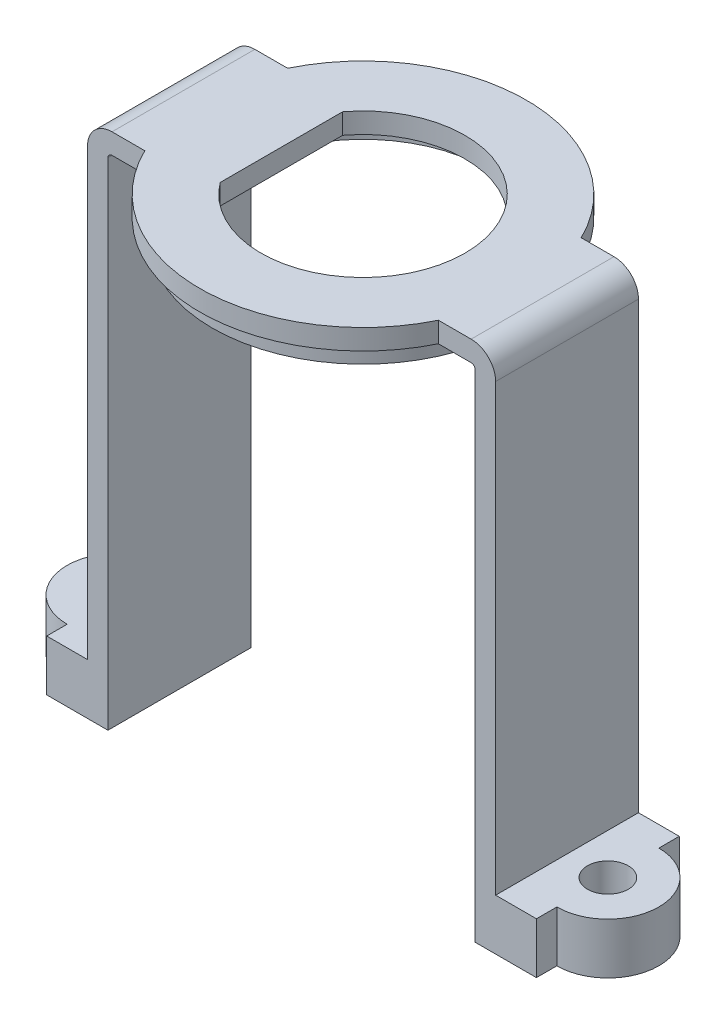
ISO-10303-21;
HEADER;
FILE_DESCRIPTION(('STEP AP214'),'2;1');
FILE_NAME('part.step','',(''),(''),'','','');
FILE_SCHEMA(('AUTOMOTIVE_DESIGN { 1 0 10303 214 1 1 1 1 }'));
ENDSEC;
DATA;
#1=APPLICATION_CONTEXT('core data for automotive mechanical design processes');
#2=APPLICATION_PROTOCOL_DEFINITION('international standard','automotive_design',2000,#1);
#3=PRODUCT_CONTEXT('',#1,'mechanical');
#4=PRODUCT('Part','Part','',(#3));
#5=PRODUCT_RELATED_PRODUCT_CATEGORY('part','',(#4));
#6=PRODUCT_DEFINITION_FORMATION('','',#4);
#7=PRODUCT_DEFINITION_CONTEXT('part definition',#1,'design');
#8=PRODUCT_DEFINITION('design','',#6,#7);
#9=PRODUCT_DEFINITION_SHAPE('','',#8);
#10=(LENGTH_UNIT() NAMED_UNIT(*) SI_UNIT(.MILLI.,.METRE.));
#11=(NAMED_UNIT(*) PLANE_ANGLE_UNIT() SI_UNIT($,.RADIAN.));
#12=(NAMED_UNIT(*) SI_UNIT($,.STERADIAN.) SOLID_ANGLE_UNIT());
#13=UNCERTAINTY_MEASURE_WITH_UNIT(LENGTH_MEASURE(1.E-05),#10,'distance_accuracy_value','');
#14=(GEOMETRIC_REPRESENTATION_CONTEXT(3) GLOBAL_UNCERTAINTY_ASSIGNED_CONTEXT((#13)) GLOBAL_UNIT_ASSIGNED_CONTEXT((#10,
#11,#12)) REPRESENTATION_CONTEXT('',''));
#15=CARTESIAN_POINT('',(0.,0.,0.));
#16=DIRECTION('',(0.,0.,1.));
#17=DIRECTION('',(1.,0.,0.));
#18=AXIS2_PLACEMENT_3D('',#15,#16,#17);
#19=CARTESIAN_POINT('',(0.,-1.,0.));
#20=DIRECTION('',(0.,1.,0.));
#21=DIRECTION('',(0.,0.,1.));
#22=AXIS2_PLACEMENT_3D('',#19,#20,#21);
#23=PLANE('',#22);
#24=DIRECTION('',(0.,0.,1.));
#25=VECTOR('',#24,1.);
#26=CARTESIAN_POINT('',(-4.,-1.,-3.));
#27=LINE('',#26,#25);
#28=CARTESIAN_POINT('',(-4.,-1.,-3.));
#29=VERTEX_POINT('',#28);
#30=CARTESIAN_POINT('',(-4.,-1.,3.));
#31=VERTEX_POINT('',#30);
#32=EDGE_CURVE('E311',#29,#31,#27,.T.);
#33=ORIENTED_EDGE('',*,*,#32,.T.);
#34=CARTESIAN_POINT('',(0.,-1.,0.));
#35=DIRECTION('',(0.,1.,0.));
#36=DIRECTION('',(0.,0.,1.));
#37=AXIS2_PLACEMENT_3D('',#34,#35,#36);
#38=CIRCLE('',#37,5.);
#39=EDGE_CURVE('E308',#31,#29,#38,.T.);
#40=ORIENTED_EDGE('',*,*,#39,.T.);
#41=EDGE_LOOP('',(#33,#40));
#42=FACE_BOUND('',#41,.T.);
#43=CARTESIAN_POINT('',(0.,-1.,0.));
#44=DIRECTION('',(0.,-1.,0.));
#45=DIRECTION('',(0.,0.,-1.));
#46=AXIS2_PLACEMENT_3D('',#43,#44,#45);
#47=CIRCLE('',#46,6.125);
#48=CARTESIAN_POINT('',(0.,-1.,-6.125));
#49=VERTEX_POINT('',#48);
#50=EDGE_CURVE('E298',#49,#49,#47,.T.);
#51=ORIENTED_EDGE('',*,*,#50,.T.);
#52=EDGE_LOOP('',(#51));
#53=FACE_BOUND('',#52,.T.);
#54=ADVANCED_FACE('F32',(#42,#53),#23,.F.);
#55=CARTESIAN_POINT('',(0.,-1.,0.));
#56=DIRECTION('',(0.,1.,0.));
#57=DIRECTION('',(0.,0.,1.));
#58=AXIS2_PLACEMENT_3D('',#55,#56,#57);
#59=CYLINDRICAL_SURFACE('',#58,8.);
#60=CARTESIAN_POINT('',(0.,0.,0.));
#61=DIRECTION('',(0.,1.,0.));
#62=DIRECTION('',(0.,0.,1.));
#63=AXIS2_PLACEMENT_3D('',#60,#61,#62);
#64=CIRCLE('',#63,8.);
#65=CARTESIAN_POINT('',(-7.19374728496908,0.,3.5));
#66=VERTEX_POINT('',#65);
#67=CARTESIAN_POINT('',(7.19374728496908,0.,3.5));
#68=VERTEX_POINT('',#67);
#69=EDGE_CURVE('E321',#66,#68,#64,.T.);
#70=ORIENTED_EDGE('',*,*,#69,.F.);
#71=DIRECTION('',(0.,1.,0.));
#72=VECTOR('',#71,1.);
#73=CARTESIAN_POINT('',(-7.19374728496908,-1.,3.5));
#74=LINE('',#73,#72);
#75=CARTESIAN_POINT('',(-7.19374728496908,-1.,3.5));
#76=VERTEX_POINT('',#75);
#77=EDGE_CURVE('E356',#76,#66,#74,.T.);
#78=ORIENTED_EDGE('',*,*,#77,.F.);
#79=CARTESIAN_POINT('',(0.,-1.,0.));
#80=DIRECTION('',(0.,1.,0.));
#81=DIRECTION('',(0.,0.,1.));
#82=AXIS2_PLACEMENT_3D('',#79,#80,#81);
#83=CIRCLE('',#82,8.);
#84=CARTESIAN_POINT('',(7.19374728496908,-1.,3.5));
#85=VERTEX_POINT('',#84);
#86=EDGE_CURVE('E324',#76,#85,#83,.T.);
#87=ORIENTED_EDGE('',*,*,#86,.T.);
#88=DIRECTION('',(0.,1.,0.));
#89=VECTOR('',#88,1.);
#90=CARTESIAN_POINT('',(7.19374728496908,-1.,3.5));
#91=LINE('',#90,#89);
#92=EDGE_CURVE('E341',#85,#68,#91,.T.);
#93=ORIENTED_EDGE('',*,*,#92,.T.);
#94=EDGE_LOOP('',(#70,#78,#87,#93));
#95=FACE_BOUND('',#94,.T.);
#96=ADVANCED_FACE('F481',(#95),#59,.T.);
#97=CARTESIAN_POINT('',(-9.99999999999999,-1.,3.5));
#98=DIRECTION('',(0.,0.,1.));
#99=DIRECTION('',(1.,0.,0.));
#100=AXIS2_PLACEMENT_3D('',#97,#98,#99);
#101=PLANE('',#100);
#102=DIRECTION('',(1.,0.,0.));
#103=VECTOR('',#102,1.);
#104=CARTESIAN_POINT('',(-9.99999999999999,0.,3.5));
#105=LINE('',#104,#103);
#106=CARTESIAN_POINT('',(-8.8,0.,3.5));
#107=VERTEX_POINT('',#106);
#108=EDGE_CURVE('E328',#107,#66,#105,.T.);
#109=ORIENTED_EDGE('',*,*,#108,.F.);
#110=CARTESIAN_POINT('',(-8.8,-1.2,3.5));
#111=DIRECTION('',(0.,0.,1.));
#112=DIRECTION('',(1.,0.,0.));
#113=AXIS2_PLACEMENT_3D('',#110,#111,#112);
#114=CIRCLE('',#113,1.2);
#115=CARTESIAN_POINT('',(-9.99999999999999,-1.2,3.5));
#116=VERTEX_POINT('',#115);
#117=EDGE_CURVE('E54',#107,#116,#114,.T.);
#118=ORIENTED_EDGE('',*,*,#117,.T.);
#119=DIRECTION('',(0.,1.,0.));
#120=VECTOR('',#119,1.);
#121=CARTESIAN_POINT('',(-9.99999999999999,-1.,3.5));
#122=LINE('',#121,#120);
#123=CARTESIAN_POINT('',(-9.99999999999999,-23.,3.5));
#124=VERTEX_POINT('',#123);
#125=EDGE_CURVE('E360',#124,#116,#122,.T.);
#126=ORIENTED_EDGE('',*,*,#125,.F.);
#127=DIRECTION('',(-1.,0.,0.));
#128=VECTOR('',#127,1.);
#129=CARTESIAN_POINT('',(-8.99999999999999,-23.,3.5));
#130=LINE('',#129,#128);
#131=CARTESIAN_POINT('',(-12.,-23.,3.5));
#132=VERTEX_POINT('',#131);
#133=EDGE_CURVE('E268',#124,#132,#130,.T.);
#134=ORIENTED_EDGE('',*,*,#133,.T.);
#135=DIRECTION('',(0.,1.,0.));
#136=VECTOR('',#135,1.);
#137=CARTESIAN_POINT('',(-12.,-25.5,3.5));
#138=LINE('',#137,#136);
#139=CARTESIAN_POINT('',(-12.,-25.5,3.5));
#140=VERTEX_POINT('',#139);
#141=EDGE_CURVE('E273',#140,#132,#138,.T.);
#142=ORIENTED_EDGE('',*,*,#141,.F.);
#143=DIRECTION('',(-1.,0.,0.));
#144=VECTOR('',#143,1.);
#145=CARTESIAN_POINT('',(-8.99999999999999,-25.5,3.5));
#146=LINE('',#145,#144);
#147=CARTESIAN_POINT('',(-8.99999999999999,-25.5,3.5));
#148=VERTEX_POINT('',#147);
#149=EDGE_CURVE('E256',#148,#140,#146,.T.);
#150=ORIENTED_EDGE('',*,*,#149,.F.);
#151=DIRECTION('',(0.,1.,0.));
#152=VECTOR('',#151,1.);
#153=CARTESIAN_POINT('',(-8.99999999999999,-1.,3.5));
#154=LINE('',#153,#152);
#155=CARTESIAN_POINT('',(-8.99999999999999,-1.2,3.5));
#156=VERTEX_POINT('',#155);
#157=EDGE_CURVE('E289',#148,#156,#154,.T.);
#158=ORIENTED_EDGE('',*,*,#157,.T.);
#159=CARTESIAN_POINT('',(-8.79999999999999,-1.2,3.5));
#160=DIRECTION('',(0.,0.,1.));
#161=DIRECTION('',(1.,0.,0.));
#162=AXIS2_PLACEMENT_3D('',#159,#160,#161);
#163=CIRCLE('',#162,0.2);
#164=CARTESIAN_POINT('',(-8.79999999999999,-1.,3.5));
#165=VERTEX_POINT('',#164);
#166=EDGE_CURVE('E392',#156,#165,#163,.F.);
#167=ORIENTED_EDGE('',*,*,#166,.T.);
#168=DIRECTION('',(1.,0.,0.));
#169=VECTOR('',#168,1.);
#170=CARTESIAN_POINT('',(-9.99999999999999,-1.,3.5));
#171=LINE('',#170,#169);
#172=EDGE_CURVE('E339',#165,#76,#171,.T.);
#173=ORIENTED_EDGE('',*,*,#172,.T.);
#174=ORIENTED_EDGE('',*,*,#77,.T.);
#175=EDGE_LOOP('',(#109,#118,#126,#134,#142,#150,#158,#167,#173,#174));
#176=FACE_BOUND('',#175,.T.);
#177=ADVANCED_FACE('F488',(#176),#101,.T.);
#178=CARTESIAN_POINT('',(-9.99999999999999,-1.,-3.5));
#179=DIRECTION('',(-1.,0.,0.));
#180=DIRECTION('',(0.,0.,1.));
#181=AXIS2_PLACEMENT_3D('',#178,#179,#180);
#182=PLANE('',#181);
#183=ORIENTED_EDGE('',*,*,#125,.T.);
#184=DIRECTION('',(0.,0.,1.));
#185=VECTOR('',#184,1.);
#186=CARTESIAN_POINT('',(-9.99999999999999,-1.2,-3.5));
#187=LINE('',#186,#185);
#188=CARTESIAN_POINT('',(-9.99999999999999,-1.2,-3.5));
#189=VERTEX_POINT('',#188);
#190=EDGE_CURVE('E40',#116,#189,#187,.F.);
#191=ORIENTED_EDGE('',*,*,#190,.T.);
#192=DIRECTION('',(0.,1.,0.));
#193=VECTOR('',#192,1.);
#194=CARTESIAN_POINT('',(-9.99999999999999,-1.,-3.5));
#195=LINE('',#194,#193);
#196=CARTESIAN_POINT('',(-9.99999999999999,-23.,-3.5));
#197=VERTEX_POINT('',#196);
#198=EDGE_CURVE('E362',#197,#189,#195,.T.);
#199=ORIENTED_EDGE('',*,*,#198,.F.);
#200=DIRECTION('',(0.,0.,1.));
#201=VECTOR('',#200,1.);
#202=CARTESIAN_POINT('',(-9.99999999999999,-23.,-3.5));
#203=LINE('',#202,#201);
#204=EDGE_CURVE('E295',#197,#124,#203,.T.);
#205=ORIENTED_EDGE('',*,*,#204,.T.);
#206=EDGE_LOOP('',(#183,#191,#199,#205));
#207=FACE_BOUND('',#206,.T.);
#208=ADVANCED_FACE('F622',(#207),#182,.T.);
#209=CARTESIAN_POINT('',(-9.99999999999999,-1.,-3.5));
#210=DIRECTION('',(0.,0.,-1.));
#211=DIRECTION('',(-1.,0.,0.));
#212=AXIS2_PLACEMENT_3D('',#209,#210,#211);
#213=PLANE('',#212);
#214=ORIENTED_EDGE('',*,*,#198,.T.);
#215=CARTESIAN_POINT('',(-8.8,-1.2,-3.5));
#216=DIRECTION('',(0.,0.,-1.));
#217=DIRECTION('',(-1.,0.,0.));
#218=AXIS2_PLACEMENT_3D('',#215,#216,#217);
#219=CIRCLE('',#218,1.2);
#220=CARTESIAN_POINT('',(-8.8,0.,-3.5));
#221=VERTEX_POINT('',#220);
#222=EDGE_CURVE('E11',#189,#221,#219,.T.);
#223=ORIENTED_EDGE('',*,*,#222,.T.);
#224=DIRECTION('',(-1.,0.,0.));
#225=VECTOR('',#224,1.);
#226=CARTESIAN_POINT('',(-9.99999999999999,0.,-3.5));
#227=LINE('',#226,#225);
#228=CARTESIAN_POINT('',(-7.19374728496908,0.,-3.5));
#229=VERTEX_POINT('',#228);
#230=EDGE_CURVE('E352',#229,#221,#227,.T.);
#231=ORIENTED_EDGE('',*,*,#230,.F.);
#232=DIRECTION('',(0.,1.,0.));
#233=VECTOR('',#232,1.);
#234=CARTESIAN_POINT('',(-7.19374728496908,-1.,-3.5));
#235=LINE('',#234,#233);
#236=CARTESIAN_POINT('',(-7.19374728496908,-1.,-3.5));
#237=VERTEX_POINT('',#236);
#238=EDGE_CURVE('E364',#237,#229,#235,.T.);
#239=ORIENTED_EDGE('',*,*,#238,.F.);
#240=DIRECTION('',(-1.,0.,0.));
#241=VECTOR('',#240,1.);
#242=CARTESIAN_POINT('',(-9.99999999999999,-1.,-3.5));
#243=LINE('',#242,#241);
#244=CARTESIAN_POINT('',(-8.79999999999999,-1.,-3.5));
#245=VERTEX_POINT('',#244);
#246=EDGE_CURVE('E336',#237,#245,#243,.T.);
#247=ORIENTED_EDGE('',*,*,#246,.T.);
#248=CARTESIAN_POINT('',(-8.79999999999999,-1.2,-3.5));
#249=DIRECTION('',(0.,0.,-1.));
#250=DIRECTION('',(-1.,0.,0.));
#251=AXIS2_PLACEMENT_3D('',#248,#249,#250);
#252=CIRCLE('',#251,0.2);
#253=CARTESIAN_POINT('',(-8.99999999999999,-1.2,-3.5));
#254=VERTEX_POINT('',#253);
#255=EDGE_CURVE('E394',#245,#254,#252,.F.);
#256=ORIENTED_EDGE('',*,*,#255,.T.);
#257=DIRECTION('',(0.,1.,0.));
#258=VECTOR('',#257,1.);
#259=CARTESIAN_POINT('',(-8.99999999999999,-1.,-3.5));
#260=LINE('',#259,#258);
#261=CARTESIAN_POINT('',(-8.99999999999999,-25.5,-3.5));
#262=VERTEX_POINT('',#261);
#263=EDGE_CURVE('E292',#262,#254,#260,.T.);
#264=ORIENTED_EDGE('',*,*,#263,.F.);
#265=DIRECTION('',(1.,0.,0.));
#266=VECTOR('',#265,1.);
#267=CARTESIAN_POINT('',(-8.99999999999999,-25.5,-3.5));
#268=LINE('',#267,#266);
#269=CARTESIAN_POINT('',(-12.,-25.5,-3.5));
#270=VERTEX_POINT('',#269);
#271=EDGE_CURVE('E250',#270,#262,#268,.T.);
#272=ORIENTED_EDGE('',*,*,#271,.F.);
#273=DIRECTION('',(0.,1.,0.));
#274=VECTOR('',#273,1.);
#275=CARTESIAN_POINT('',(-12.,-25.5,-3.5));
#276=LINE('',#275,#274);
#277=CARTESIAN_POINT('',(-12.,-23.,-3.5));
#278=VERTEX_POINT('',#277);
#279=EDGE_CURVE('E276',#270,#278,#276,.T.);
#280=ORIENTED_EDGE('',*,*,#279,.T.);
#281=DIRECTION('',(1.,0.,0.));
#282=VECTOR('',#281,1.);
#283=CARTESIAN_POINT('',(-8.99999999999999,-23.,-3.5));
#284=LINE('',#283,#282);
#285=EDGE_CURVE('E265',#278,#197,#284,.T.);
#286=ORIENTED_EDGE('',*,*,#285,.T.);
#287=EDGE_LOOP('',(#214,#223,#231,#239,#247,#256,#264,#272,#280,#286));
#288=FACE_BOUND('',#287,.T.);
#289=ADVANCED_FACE('F633',(#288),#213,.T.);
#290=CARTESIAN_POINT('',(0.,-1.,0.));
#291=DIRECTION('',(0.,1.,0.));
#292=DIRECTION('',(0.,0.,1.));
#293=AXIS2_PLACEMENT_3D('',#290,#291,#292);
#294=CYLINDRICAL_SURFACE('',#293,8.);
#295=CARTESIAN_POINT('',(0.,0.,0.));
#296=DIRECTION('',(0.,1.,0.));
#297=DIRECTION('',(0.,0.,1.));
#298=AXIS2_PLACEMENT_3D('',#295,#296,#297);
#299=CIRCLE('',#298,8.);
#300=CARTESIAN_POINT('',(7.19374728496908,0.,-3.5));
#301=VERTEX_POINT('',#300);
#302=EDGE_CURVE('E349',#301,#229,#299,.T.);
#303=ORIENTED_EDGE('',*,*,#302,.F.);
#304=DIRECTION('',(0.,1.,0.));
#305=VECTOR('',#304,1.);
#306=CARTESIAN_POINT('',(7.19374728496908,-1.,-3.5));
#307=LINE('',#306,#305);
#308=CARTESIAN_POINT('',(7.19374728496908,-1.,-3.5));
#309=VERTEX_POINT('',#308);
#310=EDGE_CURVE('E366',#309,#301,#307,.T.);
#311=ORIENTED_EDGE('',*,*,#310,.F.);
#312=CARTESIAN_POINT('',(0.,-1.,0.));
#313=DIRECTION('',(0.,1.,0.));
#314=DIRECTION('',(0.,0.,1.));
#315=AXIS2_PLACEMENT_3D('',#312,#313,#314);
#316=CIRCLE('',#315,8.);
#317=EDGE_CURVE('E333',#309,#237,#316,.T.);
#318=ORIENTED_EDGE('',*,*,#317,.T.);
#319=ORIENTED_EDGE('',*,*,#238,.T.);
#320=EDGE_LOOP('',(#303,#311,#318,#319));
#321=FACE_BOUND('',#320,.T.);
#322=ADVANCED_FACE('F643',(#321),#294,.T.);
#323=CARTESIAN_POINT('',(7.19374728496908,-1.,-3.5));
#324=DIRECTION('',(0.,0.,-1.));
#325=DIRECTION('',(-1.,0.,0.));
#326=AXIS2_PLACEMENT_3D('',#323,#324,#325);
#327=PLANE('',#326);
#328=DIRECTION('',(-1.,0.,0.));
#329=VECTOR('',#328,1.);
#330=CARTESIAN_POINT('',(7.19374728496908,0.,-3.5));
#331=LINE('',#330,#329);
#332=CARTESIAN_POINT('',(8.8,0.,-3.5));
#333=VERTEX_POINT('',#332);
#334=EDGE_CURVE('E347',#333,#301,#331,.T.);
#335=ORIENTED_EDGE('',*,*,#334,.F.);
#336=CARTESIAN_POINT('',(8.8,-1.2,-3.5));
#337=DIRECTION('',(0.,0.,-1.));
#338=DIRECTION('',(-1.,0.,0.));
#339=AXIS2_PLACEMENT_3D('',#336,#337,#338);
#340=CIRCLE('',#339,1.2);
#341=CARTESIAN_POINT('',(10.,-1.2,-3.5));
#342=VERTEX_POINT('',#341);
#343=EDGE_CURVE('E402',#333,#342,#340,.T.);
#344=ORIENTED_EDGE('',*,*,#343,.T.);
#345=DIRECTION('',(0.,1.,0.));
#346=VECTOR('',#345,1.);
#347=CARTESIAN_POINT('',(10.,-1.,-3.5));
#348=LINE('',#347,#346);
#349=CARTESIAN_POINT('',(10.,-23.,-3.5));
#350=VERTEX_POINT('',#349);
#351=EDGE_CURVE('E369',#350,#342,#348,.T.);
#352=ORIENTED_EDGE('',*,*,#351,.F.);
#353=DIRECTION('',(1.,0.,0.));
#354=VECTOR('',#353,1.);
#355=CARTESIAN_POINT('',(8.99999999999999,-23.,-3.5));
#356=LINE('',#355,#354);
#357=CARTESIAN_POINT('',(12.,-23.,-3.5));
#358=VERTEX_POINT('',#357);
#359=EDGE_CURVE('E430',#350,#358,#356,.T.);
#360=ORIENTED_EDGE('',*,*,#359,.T.);
#361=DIRECTION('',(0.,1.,0.));
#362=VECTOR('',#361,1.);
#363=CARTESIAN_POINT('',(12.,-25.5,-3.5));
#364=LINE('',#363,#362);
#365=CARTESIAN_POINT('',(12.,-25.5,-3.5));
#366=VERTEX_POINT('',#365);
#367=EDGE_CURVE('E237',#366,#358,#364,.T.);
#368=ORIENTED_EDGE('',*,*,#367,.F.);
#369=DIRECTION('',(1.,0.,0.));
#370=VECTOR('',#369,1.);
#371=CARTESIAN_POINT('',(8.99999999999999,-25.5,-3.5));
#372=LINE('',#371,#370);
#373=CARTESIAN_POINT('',(8.99999999999999,-25.5,-3.5));
#374=VERTEX_POINT('',#373);
#375=EDGE_CURVE('E447',#374,#366,#372,.T.);
#376=ORIENTED_EDGE('',*,*,#375,.F.);
#377=DIRECTION('',(0.,-1.,0.));
#378=VECTOR('',#377,1.);
#379=CARTESIAN_POINT('',(8.99999999999999,-0.999999999999998,-3.5));
#380=LINE('',#379,#378);
#381=CARTESIAN_POINT('',(8.99999999999999,-1.2,-3.5));
#382=VERTEX_POINT('',#381);
#383=EDGE_CURVE('E284',#382,#374,#380,.T.);
#384=ORIENTED_EDGE('',*,*,#383,.F.);
#385=CARTESIAN_POINT('',(8.79999999999999,-1.2,-3.5));
#386=DIRECTION('',(0.,0.,-1.));
#387=DIRECTION('',(-1.,0.,0.));
#388=AXIS2_PLACEMENT_3D('',#385,#386,#387);
#389=CIRCLE('',#388,0.2);
#390=CARTESIAN_POINT('',(8.79999999999999,-1.,-3.5));
#391=VERTEX_POINT('',#390);
#392=EDGE_CURVE('E390',#382,#391,#389,.F.);
#393=ORIENTED_EDGE('',*,*,#392,.T.);
#394=DIRECTION('',(-1.,0.,0.));
#395=VECTOR('',#394,1.);
#396=CARTESIAN_POINT('',(7.19374728496908,-1.,-3.5));
#397=LINE('',#396,#395);
#398=EDGE_CURVE('E331',#391,#309,#397,.T.);
#399=ORIENTED_EDGE('',*,*,#398,.T.);
#400=ORIENTED_EDGE('',*,*,#310,.T.);
#401=EDGE_LOOP('',(#335,#344,#352,#360,#368,#376,#384,#393,#399,#400));
#402=FACE_BOUND('',#401,.T.);
#403=ADVANCED_FACE('F422',(#402),#327,.T.);
#404=CARTESIAN_POINT('',(10.,-1.,-3.5));
#405=DIRECTION('',(1.,0.,0.));
#406=DIRECTION('',(0.,0.,-1.));
#407=AXIS2_PLACEMENT_3D('',#404,#405,#406);
#408=PLANE('',#407);
#409=ORIENTED_EDGE('',*,*,#351,.T.);
#410=DIRECTION('',(0.,0.,-1.));
#411=VECTOR('',#410,1.);
#412=CARTESIAN_POINT('',(10.,-1.2,-3.5));
#413=LINE('',#412,#411);
#414=CARTESIAN_POINT('',(10.,-1.2,3.5));
#415=VERTEX_POINT('',#414);
#416=EDGE_CURVE('E404',#342,#415,#413,.F.);
#417=ORIENTED_EDGE('',*,*,#416,.T.);
#418=DIRECTION('',(0.,1.,0.));
#419=VECTOR('',#418,1.);
#420=CARTESIAN_POINT('',(10.,-1.,3.5));
#421=LINE('',#420,#419);
#422=CARTESIAN_POINT('',(10.,-23.,3.5));
#423=VERTEX_POINT('',#422);
#424=EDGE_CURVE('E372',#423,#415,#421,.T.);
#425=ORIENTED_EDGE('',*,*,#424,.F.);
#426=DIRECTION('',(0.,0.,1.));
#427=VECTOR('',#426,1.);
#428=CARTESIAN_POINT('',(10.,-23.,-3.5));
#429=LINE('',#428,#427);
#430=EDGE_CURVE('E286',#350,#423,#429,.T.);
#431=ORIENTED_EDGE('',*,*,#430,.F.);
#432=EDGE_LOOP('',(#409,#417,#425,#431));
#433=FACE_BOUND('',#432,.T.);
#434=ADVANCED_FACE('F425',(#433),#408,.T.);
#435=CARTESIAN_POINT('',(7.19374728496908,-1.,3.5));
#436=DIRECTION('',(0.,0.,1.));
#437=DIRECTION('',(1.,0.,0.));
#438=AXIS2_PLACEMENT_3D('',#435,#436,#437);
#439=PLANE('',#438);
#440=ORIENTED_EDGE('',*,*,#424,.T.);
#441=CARTESIAN_POINT('',(8.8,-1.2,3.5));
#442=DIRECTION('',(0.,0.,1.));
#443=DIRECTION('',(1.,0.,0.));
#444=AXIS2_PLACEMENT_3D('',#441,#442,#443);
#445=CIRCLE('',#444,1.2);
#446=CARTESIAN_POINT('',(8.8,0.,3.5));
#447=VERTEX_POINT('',#446);
#448=EDGE_CURVE('E406',#415,#447,#445,.T.);
#449=ORIENTED_EDGE('',*,*,#448,.T.);
#450=DIRECTION('',(1.,0.,0.));
#451=VECTOR('',#450,1.);
#452=CARTESIAN_POINT('',(7.19374728496908,0.,3.5));
#453=LINE('',#452,#451);
#454=EDGE_CURVE('E344',#68,#447,#453,.T.);
#455=ORIENTED_EDGE('',*,*,#454,.F.);
#456=ORIENTED_EDGE('',*,*,#92,.F.);
#457=DIRECTION('',(1.,0.,0.));
#458=VECTOR('',#457,1.);
#459=CARTESIAN_POINT('',(7.19374728496908,-1.,3.5));
#460=LINE('',#459,#458);
#461=CARTESIAN_POINT('',(8.79999999999999,-1.,3.5));
#462=VERTEX_POINT('',#461);
#463=EDGE_CURVE('E327',#85,#462,#460,.T.);
#464=ORIENTED_EDGE('',*,*,#463,.T.);
#465=CARTESIAN_POINT('',(8.79999999999999,-1.2,3.5));
#466=DIRECTION('',(0.,0.,1.));
#467=DIRECTION('',(1.,0.,0.));
#468=AXIS2_PLACEMENT_3D('',#465,#466,#467);
#469=CIRCLE('',#468,0.2);
#470=CARTESIAN_POINT('',(8.99999999999999,-1.2,3.5));
#471=VERTEX_POINT('',#470);
#472=EDGE_CURVE('E388',#462,#471,#469,.F.);
#473=ORIENTED_EDGE('',*,*,#472,.T.);
#474=DIRECTION('',(0.,-1.,0.));
#475=VECTOR('',#474,1.);
#476=CARTESIAN_POINT('',(8.99999999999999,-0.999999999999998,3.5));
#477=LINE('',#476,#475);
#478=CARTESIAN_POINT('',(8.99999999999999,-25.5,3.5));
#479=VERTEX_POINT('',#478);
#480=EDGE_CURVE('E282',#471,#479,#477,.T.);
#481=ORIENTED_EDGE('',*,*,#480,.T.);
#482=DIRECTION('',(-1.,0.,0.));
#483=VECTOR('',#482,1.);
#484=CARTESIAN_POINT('',(8.99999999999999,-25.5,3.5));
#485=LINE('',#484,#483);
#486=CARTESIAN_POINT('',(12.,-25.5,3.5));
#487=VERTEX_POINT('',#486);
#488=EDGE_CURVE('E216',#487,#479,#485,.T.);
#489=ORIENTED_EDGE('',*,*,#488,.F.);
#490=DIRECTION('',(0.,1.,0.));
#491=VECTOR('',#490,1.);
#492=CARTESIAN_POINT('',(12.,-25.5,3.5));
#493=LINE('',#492,#491);
#494=CARTESIAN_POINT('',(12.,-23.,3.5));
#495=VERTEX_POINT('',#494);
#496=EDGE_CURVE('E212',#487,#495,#493,.T.);
#497=ORIENTED_EDGE('',*,*,#496,.T.);
#498=DIRECTION('',(-1.,0.,0.));
#499=VECTOR('',#498,1.);
#500=CARTESIAN_POINT('',(8.99999999999999,-23.,3.5));
#501=LINE('',#500,#499);
#502=EDGE_CURVE('E435',#495,#423,#501,.T.);
#503=ORIENTED_EDGE('',*,*,#502,.T.);
#504=EDGE_LOOP('',(#440,#449,#455,#456,#464,#473,#481,#489,#497,#503));
#505=FACE_BOUND('',#504,.T.);
#506=ADVANCED_FACE('F411',(#505),#439,.T.);
#507=CARTESIAN_POINT('',(0.,-1.,0.));
#508=DIRECTION('',(0.,1.,0.));
#509=DIRECTION('',(0.,0.,1.));
#510=AXIS2_PLACEMENT_3D('',#507,#508,#509);
#511=CIRCLE('',#510,7.375);
#512=CARTESIAN_POINT('',(0.,-1.,7.375));
#513=VERTEX_POINT('',#512);
#514=EDGE_CURVE('E359',#513,#513,#511,.F.);
#515=ORIENTED_EDGE('',*,*,#514,.F.);
#516=EDGE_LOOP('',(#515));
#517=FACE_BOUND('',#516,.T.);
#518=ORIENTED_EDGE('',*,*,#398,.F.);
#519=DIRECTION('',(0.,0.,1.));
#520=VECTOR('',#519,1.);
#521=CARTESIAN_POINT('',(8.79999999999999,-1.,0.));
#522=LINE('',#521,#520);
#523=EDGE_CURVE('E380',#391,#462,#522,.T.);
#524=ORIENTED_EDGE('',*,*,#523,.T.);
#525=ORIENTED_EDGE('',*,*,#463,.F.);
#526=ORIENTED_EDGE('',*,*,#86,.F.);
#527=ORIENTED_EDGE('',*,*,#172,.F.);
#528=DIRECTION('',(0.,0.,1.));
#529=VECTOR('',#528,1.);
#530=CARTESIAN_POINT('',(-8.79999999999999,-1.,0.));
#531=LINE('',#530,#529);
#532=EDGE_CURVE('E378',#165,#245,#531,.F.);
#533=ORIENTED_EDGE('',*,*,#532,.T.);
#534=ORIENTED_EDGE('',*,*,#246,.F.);
#535=ORIENTED_EDGE('',*,*,#317,.F.);
#536=EDGE_LOOP('',(#518,#524,#525,#526,#527,#533,#534,#535));
#537=FACE_BOUND('',#536,.T.);
#538=ADVANCED_FACE('F484',(#517,#537),#23,.F.);
#539=CARTESIAN_POINT('',(0.,0.,0.));
#540=DIRECTION('',(0.,1.,0.));
#541=DIRECTION('',(0.,0.,1.));
#542=AXIS2_PLACEMENT_3D('',#539,#540,#541);
#543=PLANE('',#542);
#544=CARTESIAN_POINT('',(0.,0.,0.));
#545=DIRECTION('',(0.,1.,0.));
#546=DIRECTION('',(0.,0.,1.));
#547=AXIS2_PLACEMENT_3D('',#544,#545,#546);
#548=CIRCLE('',#547,5.);
#549=CARTESIAN_POINT('',(-4.,0.,3.));
#550=VERTEX_POINT('',#549);
#551=CARTESIAN_POINT('',(-4.,0.,-3.));
#552=VERTEX_POINT('',#551);
#553=EDGE_CURVE('E307',#550,#552,#548,.T.);
#554=ORIENTED_EDGE('',*,*,#553,.F.);
#555=DIRECTION('',(0.,0.,1.));
#556=VECTOR('',#555,1.);
#557=CARTESIAN_POINT('',(-4.,0.,-3.));
#558=LINE('',#557,#556);
#559=EDGE_CURVE('E312',#552,#550,#558,.T.);
#560=ORIENTED_EDGE('',*,*,#559,.F.);
#561=EDGE_LOOP('',(#554,#560));
#562=FACE_BOUND('',#561,.T.);
#563=ORIENTED_EDGE('',*,*,#454,.T.);
#564=DIRECTION('',(0.,0.,-1.));
#565=VECTOR('',#564,1.);
#566=CARTESIAN_POINT('',(8.8,0.,0.));
#567=LINE('',#566,#565);
#568=EDGE_CURVE('E399',#447,#333,#567,.T.);
#569=ORIENTED_EDGE('',*,*,#568,.T.);
#570=ORIENTED_EDGE('',*,*,#334,.T.);
#571=ORIENTED_EDGE('',*,*,#302,.T.);
#572=ORIENTED_EDGE('',*,*,#230,.T.);
#573=DIRECTION('',(0.,0.,1.));
#574=VECTOR('',#573,1.);
#575=CARTESIAN_POINT('',(-8.8,0.,0.));
#576=LINE('',#575,#574);
#577=EDGE_CURVE('E396',#221,#107,#576,.T.);
#578=ORIENTED_EDGE('',*,*,#577,.T.);
#579=ORIENTED_EDGE('',*,*,#108,.T.);
#580=ORIENTED_EDGE('',*,*,#69,.T.);
#581=EDGE_LOOP('',(#563,#569,#570,#571,#572,#578,#579,#580));
#582=FACE_BOUND('',#581,.T.);
#583=ADVANCED_FACE('F417',(#562,#582),#543,.T.);
#584=CARTESIAN_POINT('',(0.,-1.,0.));
#585=DIRECTION('',(0.,1.,0.));
#586=DIRECTION('',(0.,0.,1.));
#587=AXIS2_PLACEMENT_3D('',#584,#585,#586);
#588=CYLINDRICAL_SURFACE('',#587,5.);
#589=ORIENTED_EDGE('',*,*,#553,.T.);
#590=DIRECTION('',(0.,1.,0.));
#591=VECTOR('',#590,1.);
#592=CARTESIAN_POINT('',(-4.,-1.,-3.));
#593=LINE('',#592,#591);
#594=EDGE_CURVE('E315',#29,#552,#593,.T.);
#595=ORIENTED_EDGE('',*,*,#594,.F.);
#596=ORIENTED_EDGE('',*,*,#39,.F.);
#597=DIRECTION('',(0.,1.,0.));
#598=VECTOR('',#597,1.);
#599=CARTESIAN_POINT('',(-4.,-1.,3.));
#600=LINE('',#599,#598);
#601=EDGE_CURVE('E319',#31,#550,#600,.T.);
#602=ORIENTED_EDGE('',*,*,#601,.T.);
#603=EDGE_LOOP('',(#589,#595,#596,#602));
#604=FACE_BOUND('',#603,.T.);
#605=ADVANCED_FACE('F500',(#604),#588,.F.);
#606=CARTESIAN_POINT('',(-4.,-1.,-3.));
#607=DIRECTION('',(-1.,0.,0.));
#608=DIRECTION('',(0.,0.,1.));
#609=AXIS2_PLACEMENT_3D('',#606,#607,#608);
#610=PLANE('',#609);
#611=ORIENTED_EDGE('',*,*,#559,.T.);
#612=ORIENTED_EDGE('',*,*,#601,.F.);
#613=ORIENTED_EDGE('',*,*,#32,.F.);
#614=ORIENTED_EDGE('',*,*,#594,.T.);
#615=EDGE_LOOP('',(#611,#612,#613,#614));
#616=FACE_BOUND('',#615,.T.);
#617=ADVANCED_FACE('F541',(#616),#610,.F.);
#618=CARTESIAN_POINT('',(0.,-2.,0.));
#619=DIRECTION('',(0.,-1.,0.));
#620=DIRECTION('',(0.,0.,-1.));
#621=AXIS2_PLACEMENT_3D('',#618,#619,#620);
#622=PLANE('',#621);
#623=CARTESIAN_POINT('',(0.,-2.,0.));
#624=DIRECTION('',(0.,-1.,0.));
#625=DIRECTION('',(0.,0.,-1.));
#626=AXIS2_PLACEMENT_3D('',#623,#624,#625);
#627=CIRCLE('',#626,7.375);
#628=CARTESIAN_POINT('',(0.,-2.,-7.375));
#629=VERTEX_POINT('',#628);
#630=EDGE_CURVE('E302',#629,#629,#627,.T.);
#631=ORIENTED_EDGE('',*,*,#630,.T.);
#632=EDGE_LOOP('',(#631));
#633=FACE_BOUND('',#632,.T.);
#634=CARTESIAN_POINT('',(0.,-2.,0.));
#635=DIRECTION('',(0.,-1.,0.));
#636=DIRECTION('',(0.,0.,-1.));
#637=AXIS2_PLACEMENT_3D('',#634,#635,#636);
#638=CIRCLE('',#637,6.125);
#639=CARTESIAN_POINT('',(0.,-2.,-6.125));
#640=VERTEX_POINT('',#639);
#641=EDGE_CURVE('E299',#640,#640,#638,.T.);
#642=ORIENTED_EDGE('',*,*,#641,.F.);
#643=EDGE_LOOP('',(#642));
#644=FACE_BOUND('',#643,.T.);
#645=ADVANCED_FACE('F538',(#633,#644),#622,.T.);
#646=CARTESIAN_POINT('',(0.,-2.,0.));
#647=DIRECTION('',(0.,1.,0.));
#648=DIRECTION('',(0.,0.,1.));
#649=AXIS2_PLACEMENT_3D('',#646,#647,#648);
#650=CYLINDRICAL_SURFACE('',#649,7.375);
#651=ORIENTED_EDGE('',*,*,#630,.F.);
#652=EDGE_LOOP('',(#651));
#653=FACE_BOUND('',#652,.T.);
#654=ORIENTED_EDGE('',*,*,#514,.T.);
#655=EDGE_LOOP('',(#654));
#656=FACE_BOUND('',#655,.T.);
#657=ADVANCED_FACE('F536',(#653,#656),#650,.T.);
#658=CARTESIAN_POINT('',(0.,-2.,0.));
#659=DIRECTION('',(0.,1.,0.));
#660=DIRECTION('',(0.,0.,1.));
#661=AXIS2_PLACEMENT_3D('',#658,#659,#660);
#662=CYLINDRICAL_SURFACE('',#661,6.125);
#663=ORIENTED_EDGE('',*,*,#641,.T.);
#664=EDGE_LOOP('',(#663));
#665=FACE_BOUND('',#664,.T.);
#666=ORIENTED_EDGE('',*,*,#50,.F.);
#667=EDGE_LOOP('',(#666));
#668=FACE_BOUND('',#667,.T.);
#669=ADVANCED_FACE('F527',(#665,#668),#662,.F.);
#670=CARTESIAN_POINT('',(-8.99999999999999,-1.,-3.5));
#671=DIRECTION('',(1.,0.,0.));
#672=DIRECTION('',(0.,1.,0.));
#673=AXIS2_PLACEMENT_3D('',#670,#671,#672);
#674=PLANE('',#673);
#675=ORIENTED_EDGE('',*,*,#263,.T.);
#676=DIRECTION('',(0.,0.,1.));
#677=VECTOR('',#676,1.);
#678=CARTESIAN_POINT('',(-8.99999999999999,-1.2,-3.5));
#679=LINE('',#678,#677);
#680=EDGE_CURVE('E385',#254,#156,#679,.T.);
#681=ORIENTED_EDGE('',*,*,#680,.T.);
#682=ORIENTED_EDGE('',*,*,#157,.F.);
#683=DIRECTION('',(0.,0.,1.));
#684=VECTOR('',#683,1.);
#685=CARTESIAN_POINT('',(-8.99999999999999,-25.5,3.5));
#686=LINE('',#685,#684);
#687=EDGE_CURVE('E253',#262,#148,#686,.T.);
#688=ORIENTED_EDGE('',*,*,#687,.F.);
#689=EDGE_LOOP('',(#675,#681,#682,#688));
#690=FACE_BOUND('',#689,.T.);
#691=ADVANCED_FACE('F518',(#690),#674,.T.);
#692=CARTESIAN_POINT('',(8.99999999999999,-0.999999999999998,-3.5));
#693=DIRECTION('',(-1.,0.,0.));
#694=DIRECTION('',(0.,-1.,0.));
#695=AXIS2_PLACEMENT_3D('',#692,#693,#694);
#696=PLANE('',#695);
#697=ORIENTED_EDGE('',*,*,#480,.F.);
#698=DIRECTION('',(0.,0.,1.));
#699=VECTOR('',#698,1.);
#700=CARTESIAN_POINT('',(8.99999999999999,-1.2,-3.5));
#701=LINE('',#700,#699);
#702=EDGE_CURVE('E383',#471,#382,#701,.F.);
#703=ORIENTED_EDGE('',*,*,#702,.T.);
#704=ORIENTED_EDGE('',*,*,#383,.T.);
#705=DIRECTION('',(0.,0.,-1.));
#706=VECTOR('',#705,1.);
#707=CARTESIAN_POINT('',(8.99999999999999,-25.5,3.5));
#708=LINE('',#707,#706);
#709=EDGE_CURVE('E450',#479,#374,#708,.T.);
#710=ORIENTED_EDGE('',*,*,#709,.F.);
#711=EDGE_LOOP('',(#697,#703,#704,#710));
#712=FACE_BOUND('',#711,.T.);
#713=ADVANCED_FACE('F515',(#712),#696,.T.);
#714=CARTESIAN_POINT('',(-12.,-25.5,0.));
#715=DIRECTION('',(0.,-1.,0.));
#716=DIRECTION('',(0.,0.,-1.));
#717=AXIS2_PLACEMENT_3D('',#714,#715,#716);
#718=PLANE('',#717);
#719=CARTESIAN_POINT('',(-12.,-25.5,0.));
#720=DIRECTION('',(0.,-1.,0.));
#721=DIRECTION('',(0.,0.,-1.));
#722=AXIS2_PLACEMENT_3D('',#719,#720,#721);
#723=CIRCLE('',#722,2.5);
#724=CARTESIAN_POINT('',(-12.,-25.5,2.5));
#725=VERTEX_POINT('',#724);
#726=CARTESIAN_POINT('',(-12.,-25.5,-2.5));
#727=VERTEX_POINT('',#726);
#728=EDGE_CURVE('E244',#725,#727,#723,.T.);
#729=ORIENTED_EDGE('',*,*,#728,.T.);
#730=DIRECTION('',(0.,0.,-1.));
#731=VECTOR('',#730,1.);
#732=CARTESIAN_POINT('',(-12.,-25.5,-2.5));
#733=LINE('',#732,#731);
#734=EDGE_CURVE('E247',#727,#270,#733,.T.);
#735=ORIENTED_EDGE('',*,*,#734,.T.);
#736=ORIENTED_EDGE('',*,*,#271,.T.);
#737=ORIENTED_EDGE('',*,*,#687,.T.);
#738=ORIENTED_EDGE('',*,*,#149,.T.);
#739=DIRECTION('',(0.,0.,-1.));
#740=VECTOR('',#739,1.);
#741=CARTESIAN_POINT('',(-12.,-25.5,2.5));
#742=LINE('',#741,#740);
#743=EDGE_CURVE('E258',#140,#725,#742,.T.);
#744=ORIENTED_EDGE('',*,*,#743,.T.);
#745=EDGE_LOOP('',(#729,#735,#736,#737,#738,#744));
#746=FACE_BOUND('',#745,.T.);
#747=CARTESIAN_POINT('',(-12.,-25.5,0.));
#748=DIRECTION('',(0.,-1.,0.));
#749=DIRECTION('',(0.,0.,-1.));
#750=AXIS2_PLACEMENT_3D('',#747,#748,#749);
#751=CIRCLE('',#750,1.);
#752=CARTESIAN_POINT('',(-12.,-25.5,-1.));
#753=VERTEX_POINT('',#752);
#754=EDGE_CURVE('E235',#753,#753,#751,.T.);
#755=ORIENTED_EDGE('',*,*,#754,.F.);
#756=EDGE_LOOP('',(#755));
#757=FACE_BOUND('',#756,.T.);
#758=ADVANCED_FACE('F517',(#746,#757),#718,.T.);
#759=CARTESIAN_POINT('',(-12.,-23.,0.));
#760=DIRECTION('',(0.,-1.,0.));
#761=DIRECTION('',(0.,0.,-1.));
#762=AXIS2_PLACEMENT_3D('',#759,#760,#761);
#763=PLANE('',#762);
#764=ORIENTED_EDGE('',*,*,#204,.F.);
#765=ORIENTED_EDGE('',*,*,#285,.F.);
#766=DIRECTION('',(0.,0.,-1.));
#767=VECTOR('',#766,1.);
#768=CARTESIAN_POINT('',(-12.,-23.,-2.5));
#769=LINE('',#768,#767);
#770=CARTESIAN_POINT('',(-12.,-23.,-2.5));
#771=VERTEX_POINT('',#770);
#772=EDGE_CURVE('E263',#771,#278,#769,.T.);
#773=ORIENTED_EDGE('',*,*,#772,.F.);
#774=CARTESIAN_POINT('',(-12.,-23.,0.));
#775=DIRECTION('',(0.,-1.,0.));
#776=DIRECTION('',(0.,0.,-1.));
#777=AXIS2_PLACEMENT_3D('',#774,#775,#776);
#778=CIRCLE('',#777,2.5);
#779=CARTESIAN_POINT('',(-12.,-23.,2.5));
#780=VERTEX_POINT('',#779);
#781=EDGE_CURVE('E242',#780,#771,#778,.T.);
#782=ORIENTED_EDGE('',*,*,#781,.F.);
#783=DIRECTION('',(0.,0.,-1.));
#784=VECTOR('',#783,1.);
#785=CARTESIAN_POINT('',(-12.,-23.,2.5));
#786=LINE('',#785,#784);
#787=EDGE_CURVE('E248',#132,#780,#786,.T.);
#788=ORIENTED_EDGE('',*,*,#787,.F.);
#789=ORIENTED_EDGE('',*,*,#133,.F.);
#790=EDGE_LOOP('',(#764,#765,#773,#782,#788,#789));
#791=FACE_BOUND('',#790,.T.);
#792=CARTESIAN_POINT('',(-12.,-23.,0.));
#793=DIRECTION('',(0.,-1.,0.));
#794=DIRECTION('',(0.,0.,-1.));
#795=AXIS2_PLACEMENT_3D('',#792,#793,#794);
#796=CIRCLE('',#795,1.);
#797=CARTESIAN_POINT('',(-12.,-23.,-1.));
#798=VERTEX_POINT('',#797);
#799=EDGE_CURVE('E232',#798,#798,#796,.T.);
#800=ORIENTED_EDGE('',*,*,#799,.T.);
#801=EDGE_LOOP('',(#800));
#802=FACE_BOUND('',#801,.T.);
#803=ADVANCED_FACE('F524',(#791,#802),#763,.F.);
#804=CARTESIAN_POINT('',(-12.,-25.5,0.));
#805=DIRECTION('',(0.,1.,0.));
#806=DIRECTION('',(0.,0.,1.));
#807=AXIS2_PLACEMENT_3D('',#804,#805,#806);
#808=CYLINDRICAL_SURFACE('',#807,2.5);
#809=ORIENTED_EDGE('',*,*,#781,.T.);
#810=DIRECTION('',(0.,1.,0.));
#811=VECTOR('',#810,1.);
#812=CARTESIAN_POINT('',(-12.,-25.5,-2.5));
#813=LINE('',#812,#811);
#814=EDGE_CURVE('E279',#727,#771,#813,.T.);
#815=ORIENTED_EDGE('',*,*,#814,.F.);
#816=ORIENTED_EDGE('',*,*,#728,.F.);
#817=DIRECTION('',(0.,1.,0.));
#818=VECTOR('',#817,1.);
#819=CARTESIAN_POINT('',(-12.,-25.5,2.5));
#820=LINE('',#819,#818);
#821=EDGE_CURVE('E260',#725,#780,#820,.T.);
#822=ORIENTED_EDGE('',*,*,#821,.T.);
#823=EDGE_LOOP('',(#809,#815,#816,#822));
#824=FACE_BOUND('',#823,.T.);
#825=ADVANCED_FACE('F531',(#824),#808,.T.);
#826=CARTESIAN_POINT('',(-12.,-25.5,-2.5));
#827=DIRECTION('',(1.,0.,0.));
#828=DIRECTION('',(0.,0.,-1.));
#829=AXIS2_PLACEMENT_3D('',#826,#827,#828);
#830=PLANE('',#829);
#831=ORIENTED_EDGE('',*,*,#772,.T.);
#832=ORIENTED_EDGE('',*,*,#279,.F.);
#833=ORIENTED_EDGE('',*,*,#734,.F.);
#834=ORIENTED_EDGE('',*,*,#814,.T.);
#835=EDGE_LOOP('',(#831,#832,#833,#834));
#836=FACE_BOUND('',#835,.T.);
#837=ADVANCED_FACE('F715',(#836),#830,.F.);
#838=CARTESIAN_POINT('',(-12.,-25.5,2.5));
#839=DIRECTION('',(1.,0.,0.));
#840=DIRECTION('',(0.,0.,-1.));
#841=AXIS2_PLACEMENT_3D('',#838,#839,#840);
#842=PLANE('',#841);
#843=ORIENTED_EDGE('',*,*,#787,.T.);
#844=ORIENTED_EDGE('',*,*,#821,.F.);
#845=ORIENTED_EDGE('',*,*,#743,.F.);
#846=ORIENTED_EDGE('',*,*,#141,.T.);
#847=EDGE_LOOP('',(#843,#844,#845,#846));
#848=FACE_BOUND('',#847,.T.);
#849=ADVANCED_FACE('F476',(#848),#842,.F.);
#850=CARTESIAN_POINT('',(-12.,-25.5,0.));
#851=DIRECTION('',(0.,1.,0.));
#852=DIRECTION('',(0.,0.,1.));
#853=AXIS2_PLACEMENT_3D('',#850,#851,#852);
#854=CYLINDRICAL_SURFACE('',#853,1.);
#855=ORIENTED_EDGE('',*,*,#754,.T.);
#856=EDGE_LOOP('',(#855));
#857=FACE_BOUND('',#856,.T.);
#858=ORIENTED_EDGE('',*,*,#799,.F.);
#859=EDGE_LOOP('',(#858));
#860=FACE_BOUND('',#859,.T.);
#861=ADVANCED_FACE('F469',(#857,#860),#854,.F.);
#862=CARTESIAN_POINT('',(12.,-25.5,0.));
#863=DIRECTION('',(0.,1.,0.));
#864=DIRECTION('',(0.,0.,1.));
#865=AXIS2_PLACEMENT_3D('',#862,#863,#864);
#866=PLANE('',#865);
#867=CARTESIAN_POINT('',(12.,-25.5,0.));
#868=DIRECTION('',(0.,-1.,0.));
#869=DIRECTION('',(0.,0.,1.));
#870=AXIS2_PLACEMENT_3D('',#867,#868,#869);
#871=CIRCLE('',#870,2.5);
#872=CARTESIAN_POINT('',(12.,-25.5,-2.5));
#873=VERTEX_POINT('',#872);
#874=CARTESIAN_POINT('',(12.,-25.5,2.5));
#875=VERTEX_POINT('',#874);
#876=EDGE_CURVE('E217',#873,#875,#871,.T.);
#877=ORIENTED_EDGE('',*,*,#876,.T.);
#878=DIRECTION('',(0.,0.,1.));
#879=VECTOR('',#878,1.);
#880=CARTESIAN_POINT('',(12.,-25.5,2.5));
#881=LINE('',#880,#879);
#882=EDGE_CURVE('E205',#875,#487,#881,.T.);
#883=ORIENTED_EDGE('',*,*,#882,.T.);
#884=ORIENTED_EDGE('',*,*,#488,.T.);
#885=ORIENTED_EDGE('',*,*,#709,.T.);
#886=ORIENTED_EDGE('',*,*,#375,.T.);
#887=DIRECTION('',(0.,0.,1.));
#888=VECTOR('',#887,1.);
#889=CARTESIAN_POINT('',(12.,-25.5,-2.5));
#890=LINE('',#889,#888);
#891=EDGE_CURVE('E223',#366,#873,#890,.T.);
#892=ORIENTED_EDGE('',*,*,#891,.T.);
#893=EDGE_LOOP('',(#877,#883,#884,#885,#886,#892));
#894=FACE_BOUND('',#893,.T.);
#895=CARTESIAN_POINT('',(12.,-25.5,0.));
#896=DIRECTION('',(0.,-1.,0.));
#897=DIRECTION('',(0.,0.,1.));
#898=AXIS2_PLACEMENT_3D('',#895,#896,#897);
#899=CIRCLE('',#898,1.);
#900=CARTESIAN_POINT('',(12.,-25.5,1.));
#901=VERTEX_POINT('',#900);
#902=EDGE_CURVE('E456',#901,#901,#899,.T.);
#903=ORIENTED_EDGE('',*,*,#902,.F.);
#904=EDGE_LOOP('',(#903));
#905=FACE_BOUND('',#904,.T.);
#906=ADVANCED_FACE('F220',(#894,#905),#866,.F.);
#907=CARTESIAN_POINT('',(12.,-23.,0.));
#908=DIRECTION('',(0.,1.,0.));
#909=DIRECTION('',(0.,0.,1.));
#910=AXIS2_PLACEMENT_3D('',#907,#908,#909);
#911=PLANE('',#910);
#912=ORIENTED_EDGE('',*,*,#359,.F.);
#913=ORIENTED_EDGE('',*,*,#430,.T.);
#914=ORIENTED_EDGE('',*,*,#502,.F.);
#915=DIRECTION('',(0.,0.,1.));
#916=VECTOR('',#915,1.);
#917=CARTESIAN_POINT('',(12.,-23.,2.5));
#918=LINE('',#917,#916);
#919=CARTESIAN_POINT('',(12.,-23.,2.5));
#920=VERTEX_POINT('',#919);
#921=EDGE_CURVE('E438',#920,#495,#918,.T.);
#922=ORIENTED_EDGE('',*,*,#921,.F.);
#923=CARTESIAN_POINT('',(12.,-23.,0.));
#924=DIRECTION('',(0.,-1.,0.));
#925=DIRECTION('',(0.,0.,1.));
#926=AXIS2_PLACEMENT_3D('',#923,#924,#925);
#927=CIRCLE('',#926,2.5);
#928=CARTESIAN_POINT('',(12.,-23.,-2.5));
#929=VERTEX_POINT('',#928);
#930=EDGE_CURVE('E231',#929,#920,#927,.T.);
#931=ORIENTED_EDGE('',*,*,#930,.F.);
#932=DIRECTION('',(0.,0.,1.));
#933=VECTOR('',#932,1.);
#934=CARTESIAN_POINT('',(12.,-23.,-2.5));
#935=LINE('',#934,#933);
#936=EDGE_CURVE('E227',#358,#929,#935,.T.);
#937=ORIENTED_EDGE('',*,*,#936,.F.);
#938=EDGE_LOOP('',(#912,#913,#914,#922,#931,#937));
#939=FACE_BOUND('',#938,.T.);
#940=CARTESIAN_POINT('',(12.,-23.,0.));
#941=DIRECTION('',(0.,-1.,0.));
#942=DIRECTION('',(0.,0.,1.));
#943=AXIS2_PLACEMENT_3D('',#940,#941,#942);
#944=CIRCLE('',#943,1.);
#945=CARTESIAN_POINT('',(12.,-23.,1.));
#946=VERTEX_POINT('',#945);
#947=EDGE_CURVE('E460',#946,#946,#944,.T.);
#948=ORIENTED_EDGE('',*,*,#947,.T.);
#949=EDGE_LOOP('',(#948));
#950=FACE_BOUND('',#949,.T.);
#951=ADVANCED_FACE('F431',(#939,#950),#911,.T.);
#952=CARTESIAN_POINT('',(12.,-25.5,0.));
#953=DIRECTION('',(0.,1.,0.));
#954=DIRECTION('',(0.,0.,1.));
#955=AXIS2_PLACEMENT_3D('',#952,#953,#954);
#956=CYLINDRICAL_SURFACE('',#955,2.5);
#957=ORIENTED_EDGE('',*,*,#930,.T.);
#958=DIRECTION('',(0.,1.,0.));
#959=VECTOR('',#958,1.);
#960=CARTESIAN_POINT('',(12.,-25.5,2.5));
#961=LINE('',#960,#959);
#962=EDGE_CURVE('E209',#875,#920,#961,.T.);
#963=ORIENTED_EDGE('',*,*,#962,.F.);
#964=ORIENTED_EDGE('',*,*,#876,.F.);
#965=DIRECTION('',(0.,1.,0.));
#966=VECTOR('',#965,1.);
#967=CARTESIAN_POINT('',(12.,-25.5,-2.5));
#968=LINE('',#967,#966);
#969=EDGE_CURVE('E442',#873,#929,#968,.T.);
#970=ORIENTED_EDGE('',*,*,#969,.T.);
#971=EDGE_LOOP('',(#957,#963,#964,#970));
#972=FACE_BOUND('',#971,.T.);
#973=ADVANCED_FACE('F229',(#972),#956,.T.);
#974=CARTESIAN_POINT('',(12.,-25.5,2.5));
#975=DIRECTION('',(-1.,0.,0.));
#976=DIRECTION('',(0.,0.,1.));
#977=AXIS2_PLACEMENT_3D('',#974,#975,#976);
#978=PLANE('',#977);
#979=ORIENTED_EDGE('',*,*,#921,.T.);
#980=ORIENTED_EDGE('',*,*,#496,.F.);
#981=ORIENTED_EDGE('',*,*,#882,.F.);
#982=ORIENTED_EDGE('',*,*,#962,.T.);
#983=EDGE_LOOP('',(#979,#980,#981,#982));
#984=FACE_BOUND('',#983,.T.);
#985=ADVANCED_FACE('F207',(#984),#978,.F.);
#986=CARTESIAN_POINT('',(12.,-25.5,-2.5));
#987=DIRECTION('',(-1.,0.,0.));
#988=DIRECTION('',(0.,0.,1.));
#989=AXIS2_PLACEMENT_3D('',#986,#987,#988);
#990=PLANE('',#989);
#991=ORIENTED_EDGE('',*,*,#936,.T.);
#992=ORIENTED_EDGE('',*,*,#969,.F.);
#993=ORIENTED_EDGE('',*,*,#891,.F.);
#994=ORIENTED_EDGE('',*,*,#367,.T.);
#995=EDGE_LOOP('',(#991,#992,#993,#994));
#996=FACE_BOUND('',#995,.T.);
#997=ADVANCED_FACE('F444',(#996),#990,.F.);
#998=CARTESIAN_POINT('',(12.,-25.5,0.));
#999=DIRECTION('',(0.,1.,0.));
#1000=DIRECTION('',(0.,0.,1.));
#1001=AXIS2_PLACEMENT_3D('',#998,#999,#1000);
#1002=CYLINDRICAL_SURFACE('',#1001,1.);
#1003=ORIENTED_EDGE('',*,*,#902,.T.);
#1004=EDGE_LOOP('',(#1003));
#1005=FACE_BOUND('',#1004,.T.);
#1006=ORIENTED_EDGE('',*,*,#947,.F.);
#1007=EDGE_LOOP('',(#1006));
#1008=FACE_BOUND('',#1007,.T.);
#1009=ADVANCED_FACE('F466',(#1005,#1008),#1002,.F.);
#1010=CARTESIAN_POINT('',(8.79999999999999,-1.2,0.));
#1011=DIRECTION('',(0.,0.,1.));
#1012=DIRECTION('',(1.,0.,0.));
#1013=AXIS2_PLACEMENT_3D('',#1010,#1011,#1012);
#1014=CYLINDRICAL_SURFACE('',#1013,0.2);
#1015=ORIENTED_EDGE('',*,*,#392,.F.);
#1016=ORIENTED_EDGE('',*,*,#702,.F.);
#1017=ORIENTED_EDGE('',*,*,#472,.F.);
#1018=ORIENTED_EDGE('',*,*,#523,.F.);
#1019=EDGE_LOOP('',(#1015,#1016,#1017,#1018));
#1020=FACE_BOUND('',#1019,.T.);
#1021=ADVANCED_FACE('F512',(#1020),#1014,.F.);
#1022=CARTESIAN_POINT('',(-8.79999999999999,-1.2,-3.5));
#1023=DIRECTION('',(0.,0.,1.));
#1024=DIRECTION('',(1.,0.,0.));
#1025=AXIS2_PLACEMENT_3D('',#1022,#1023,#1024);
#1026=CYLINDRICAL_SURFACE('',#1025,0.2);
#1027=ORIENTED_EDGE('',*,*,#255,.F.);
#1028=ORIENTED_EDGE('',*,*,#532,.F.);
#1029=ORIENTED_EDGE('',*,*,#166,.F.);
#1030=ORIENTED_EDGE('',*,*,#680,.F.);
#1031=EDGE_LOOP('',(#1027,#1028,#1029,#1030));
#1032=FACE_BOUND('',#1031,.T.);
#1033=ADVANCED_FACE('F600',(#1032),#1026,.F.);
#1034=CARTESIAN_POINT('',(8.8,-1.2,0.));
#1035=DIRECTION('',(0.,0.,-1.));
#1036=DIRECTION('',(-1.,0.,0.));
#1037=AXIS2_PLACEMENT_3D('',#1034,#1035,#1036);
#1038=CYLINDRICAL_SURFACE('',#1037,1.2);
#1039=ORIENTED_EDGE('',*,*,#448,.F.);
#1040=ORIENTED_EDGE('',*,*,#416,.F.);
#1041=ORIENTED_EDGE('',*,*,#343,.F.);
#1042=ORIENTED_EDGE('',*,*,#568,.F.);
#1043=EDGE_LOOP('',(#1039,#1040,#1041,#1042));
#1044=FACE_BOUND('',#1043,.T.);
#1045=ADVANCED_FACE('F420',(#1044),#1038,.T.);
#1046=CARTESIAN_POINT('',(-8.8,-1.2,0.));
#1047=DIRECTION('',(0.,0.,1.));
#1048=DIRECTION('',(1.,0.,0.));
#1049=AXIS2_PLACEMENT_3D('',#1046,#1047,#1048);
#1050=CYLINDRICAL_SURFACE('',#1049,1.2);
#1051=ORIENTED_EDGE('',*,*,#222,.F.);
#1052=ORIENTED_EDGE('',*,*,#190,.F.);
#1053=ORIENTED_EDGE('',*,*,#117,.F.);
#1054=ORIENTED_EDGE('',*,*,#577,.F.);
#1055=EDGE_LOOP('',(#1051,#1052,#1053,#1054));
#1056=FACE_BOUND('',#1055,.T.);
#1057=ADVANCED_FACE('F34',(#1056),#1050,.T.);
#1058=CLOSED_SHELL('',(#54,#96,#177,#208,#289,#322,#403,#434,#506,#538,#583,#605,#617,#645,#657,
#669,#691,#713,#758,#803,#825,#837,#849,#861,#906,#951,#973,#985,#997,#1009,#1021,#1033,#1045,#1057));
#1059=MANIFOLD_SOLID_BREP('B2',#1058);
#1060=ADVANCED_BREP_SHAPE_REPRESENTATION('',(#18,#1059),#14);
#1061=SHAPE_DEFINITION_REPRESENTATION(#9,#1060);
ENDSEC;
END-ISO-10303-21;
